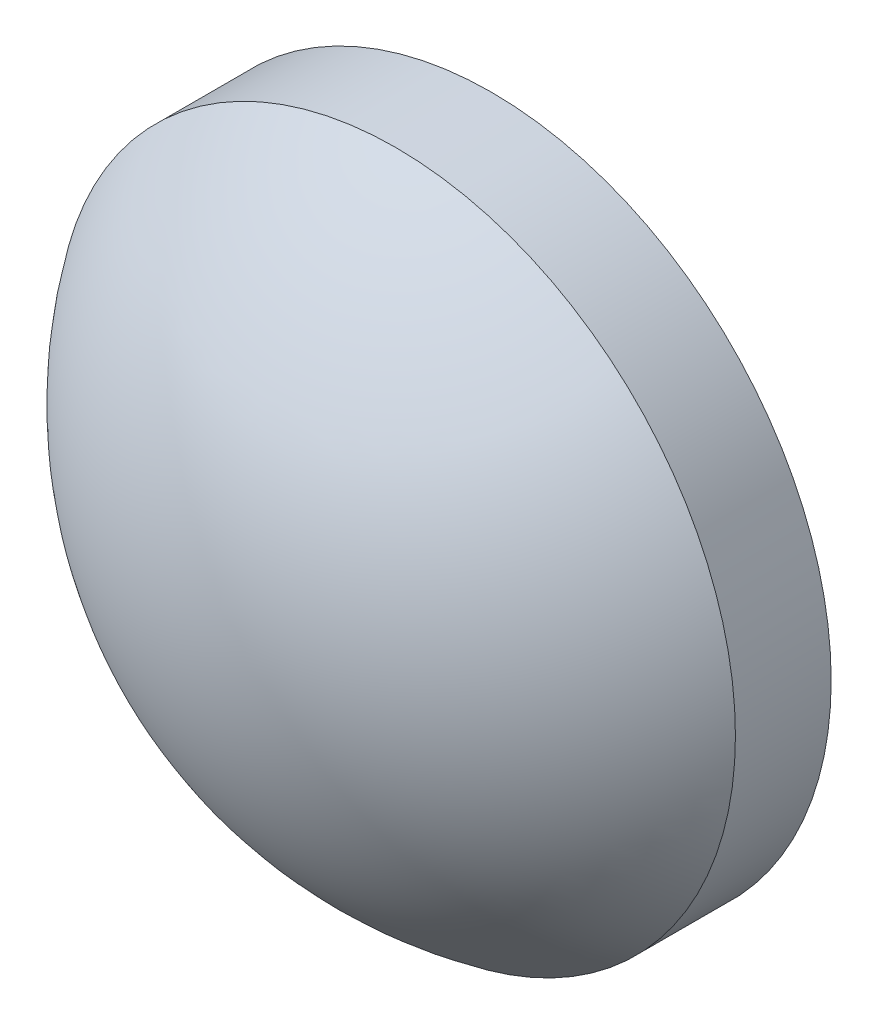
ISO-10303-21;
HEADER;
FILE_DESCRIPTION(('STEP AP214'),'2;1');
FILE_NAME('part.step','',(''),(''),'','','');
FILE_SCHEMA(('AUTOMOTIVE_DESIGN { 1 0 10303 214 1 1 1 1 }'));
ENDSEC;
DATA;
#1=APPLICATION_CONTEXT('core data for automotive mechanical design processes');
#2=APPLICATION_PROTOCOL_DEFINITION('international standard','automotive_design',2000,#1);
#3=PRODUCT_CONTEXT('',#1,'mechanical');
#4=PRODUCT('Part','Part','',(#3));
#5=PRODUCT_RELATED_PRODUCT_CATEGORY('part','',(#4));
#6=PRODUCT_DEFINITION_FORMATION('','',#4);
#7=PRODUCT_DEFINITION_CONTEXT('part definition',#1,'design');
#8=PRODUCT_DEFINITION('design','',#6,#7);
#9=PRODUCT_DEFINITION_SHAPE('','',#8);
#10=(LENGTH_UNIT() NAMED_UNIT(*) SI_UNIT(.MILLI.,.METRE.));
#11=(NAMED_UNIT(*) PLANE_ANGLE_UNIT() SI_UNIT($,.RADIAN.));
#12=(NAMED_UNIT(*) SI_UNIT($,.STERADIAN.) SOLID_ANGLE_UNIT());
#13=UNCERTAINTY_MEASURE_WITH_UNIT(LENGTH_MEASURE(1.E-05),#10,'distance_accuracy_value','');
#14=(GEOMETRIC_REPRESENTATION_CONTEXT(3) GLOBAL_UNCERTAINTY_ASSIGNED_CONTEXT((#13)) GLOBAL_UNIT_ASSIGNED_CONTEXT((#10,
#11,#12)) REPRESENTATION_CONTEXT('',''));
#15=CARTESIAN_POINT('',(0.,0.,0.));
#16=DIRECTION('',(0.,0.,1.));
#17=DIRECTION('',(1.,0.,0.));
#18=AXIS2_PLACEMENT_3D('',#15,#16,#17);
#19=CARTESIAN_POINT('',(0.,0.,-5.16));
#20=DIRECTION('',(0.,0.,1.));
#21=DIRECTION('',(0.,1.,0.));
#22=AXIS2_PLACEMENT_3D('',#19,#20,#21);
#23=SPHERICAL_SURFACE('',#22,7.72);
#24=CARTESIAN_POINT('',(0.,0.,-0.769567219510132));
#25=DIRECTION('',(0.,0.,1.));
#26=DIRECTION('',(1.,0.,0.));
#27=AXIS2_PLACEMENT_3D('',#24,#25,#26);
#28=CIRCLE('',#27,6.35);
#29=CARTESIAN_POINT('',(6.35,0.,-0.769567219510132));
#30=VERTEX_POINT('',#29);
#31=EDGE_CURVE('E8',#30,#30,#28,.T.);
#32=ORIENTED_EDGE('',*,*,#31,.T.);
#33=EDGE_LOOP('',(#32));
#34=FACE_BOUND('',#33,.T.);
#35=ADVANCED_FACE('F12',(#34),#23,.T.);
#36=CARTESIAN_POINT('',(0.,0.,4.30813204540037));
#37=DIRECTION('',(0.,0.,1.));
#38=DIRECTION('',(1.,0.,0.));
#39=AXIS2_PLACEMENT_3D('',#36,#37,#38);
#40=CYLINDRICAL_SURFACE('',#39,6.35);
#41=ORIENTED_EDGE('',*,*,#31,.F.);
#42=EDGE_LOOP('',(#41));
#43=FACE_BOUND('',#42,.T.);
#44=CARTESIAN_POINT('',(0.,0.,-2.56));
#45=DIRECTION('',(0.,0.,1.));
#46=DIRECTION('',(1.,0.,0.));
#47=AXIS2_PLACEMENT_3D('',#44,#45,#46);
#48=CIRCLE('',#47,6.35);
#49=CARTESIAN_POINT('',(6.35,0.,-2.56));
#50=VERTEX_POINT('',#49);
#51=EDGE_CURVE('E18',#50,#50,#48,.T.);
#52=ORIENTED_EDGE('',*,*,#51,.T.);
#53=EDGE_LOOP('',(#52));
#54=FACE_BOUND('',#53,.T.);
#55=ADVANCED_FACE('F24',(#43,#54),#40,.T.);
#56=CARTESIAN_POINT('',(0.,0.,-2.56));
#57=DIRECTION('',(0.,0.,1.));
#58=DIRECTION('',(1.,0.,0.));
#59=AXIS2_PLACEMENT_3D('',#56,#57,#58);
#60=PLANE('',#59);
#61=ORIENTED_EDGE('',*,*,#51,.F.);
#62=EDGE_LOOP('',(#61));
#63=FACE_BOUND('',#62,.T.);
#64=ADVANCED_FACE('F26',(#63),#60,.F.);
#65=CLOSED_SHELL('',(#35,#55,#64));
#66=MANIFOLD_SOLID_BREP('B1',#65);
#67=ADVANCED_BREP_SHAPE_REPRESENTATION('',(#18,#66),#14);
#68=SHAPE_DEFINITION_REPRESENTATION(#9,#67);
ENDSEC;
END-ISO-10303-21;
